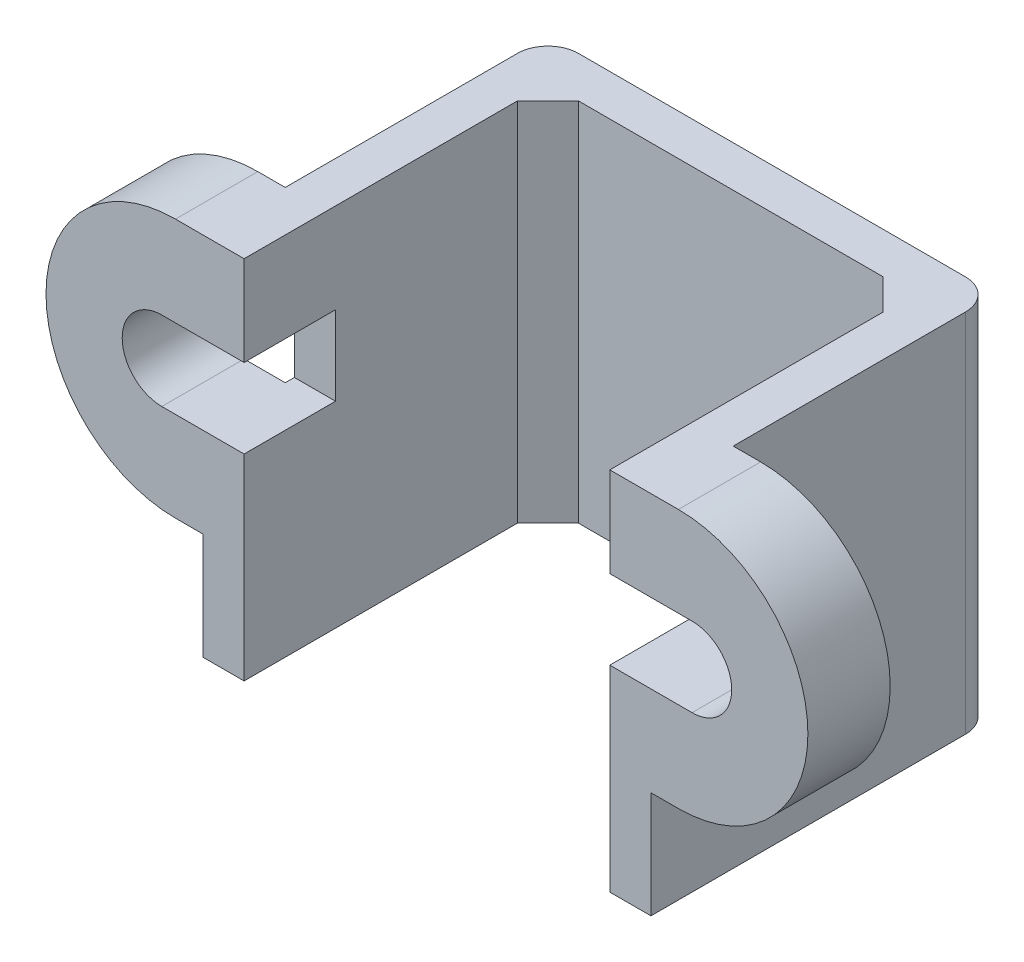
ISO-10303-21;
HEADER;
FILE_DESCRIPTION(('STEP AP214'),'2;1');
FILE_NAME('part.step','',(''),(''),'','','');
FILE_SCHEMA(('AUTOMOTIVE_DESIGN { 1 0 10303 214 1 1 1 1 }'));
ENDSEC;
DATA;
#1=APPLICATION_CONTEXT('core data for automotive mechanical design processes');
#2=APPLICATION_PROTOCOL_DEFINITION('international standard','automotive_design',2000,#1);
#3=PRODUCT_CONTEXT('',#1,'mechanical');
#4=PRODUCT('Part','Part','',(#3));
#5=PRODUCT_RELATED_PRODUCT_CATEGORY('part','',(#4));
#6=PRODUCT_DEFINITION_FORMATION('','',#4);
#7=PRODUCT_DEFINITION_CONTEXT('part definition',#1,'design');
#8=PRODUCT_DEFINITION('design','',#6,#7);
#9=PRODUCT_DEFINITION_SHAPE('','',#8);
#10=(LENGTH_UNIT() NAMED_UNIT(*) SI_UNIT(.MILLI.,.METRE.));
#11=(NAMED_UNIT(*) PLANE_ANGLE_UNIT() SI_UNIT($,.RADIAN.));
#12=(NAMED_UNIT(*) SI_UNIT($,.STERADIAN.) SOLID_ANGLE_UNIT());
#13=UNCERTAINTY_MEASURE_WITH_UNIT(LENGTH_MEASURE(1.E-05),#10,'distance_accuracy_value','');
#14=(GEOMETRIC_REPRESENTATION_CONTEXT(3) GLOBAL_UNCERTAINTY_ASSIGNED_CONTEXT((#13)) GLOBAL_UNIT_ASSIGNED_CONTEXT((#10,
#11,#12)) REPRESENTATION_CONTEXT('',''));
#15=CARTESIAN_POINT('',(0.,0.,0.));
#16=DIRECTION('',(0.,0.,1.));
#17=DIRECTION('',(1.,0.,0.));
#18=AXIS2_PLACEMENT_3D('',#15,#16,#17);
#19=CARTESIAN_POINT('',(7.35,6.,11.32));
#20=DIRECTION('',(0.,0.,1.));
#21=DIRECTION('',(1.,0.,0.));
#22=AXIS2_PLACEMENT_3D('',#19,#20,#21);
#23=PLANE('',#22);
#24=DIRECTION('',(0.,1.,0.));
#25=VECTOR('',#24,1.);
#26=CARTESIAN_POINT('',(6.,6.,11.32));
#27=LINE('',#26,#25);
#28=CARTESIAN_POINT('',(6.,3.05,11.32));
#29=VERTEX_POINT('',#28);
#30=CARTESIAN_POINT('',(6.,6.,11.32));
#31=VERTEX_POINT('',#30);
#32=EDGE_CURVE('E310',#29,#31,#27,.T.);
#33=ORIENTED_EDGE('',*,*,#32,.F.);
#34=DIRECTION('',(1.,0.,0.));
#35=VECTOR('',#34,1.);
#36=CARTESIAN_POINT('',(6.,3.05,11.32));
#37=LINE('',#36,#35);
#38=CARTESIAN_POINT('',(8.7,3.05,11.32));
#39=VERTEX_POINT('',#38);
#40=EDGE_CURVE('E255',#29,#39,#37,.T.);
#41=ORIENTED_EDGE('',*,*,#40,.T.);
#42=CARTESIAN_POINT('',(8.7,1.75,11.32));
#43=DIRECTION('',(0.,0.,-1.));
#44=DIRECTION('',(-1.,0.,0.));
#45=AXIS2_PLACEMENT_3D('',#42,#43,#44);
#46=CIRCLE('',#45,1.3);
#47=CARTESIAN_POINT('',(8.7,0.45,11.32));
#48=VERTEX_POINT('',#47);
#49=EDGE_CURVE('E787',#39,#48,#46,.T.);
#50=ORIENTED_EDGE('',*,*,#49,.T.);
#51=DIRECTION('',(-1.,0.,0.));
#52=VECTOR('',#51,1.);
#53=CARTESIAN_POINT('',(8.7,0.45,11.32));
#54=LINE('',#53,#52);
#55=CARTESIAN_POINT('',(6.,0.45,11.32));
#56=VERTEX_POINT('',#55);
#57=EDGE_CURVE('E793',#48,#56,#54,.T.);
#58=ORIENTED_EDGE('',*,*,#57,.T.);
#59=CARTESIAN_POINT('',(6.,-6.,11.32));
#60=VERTEX_POINT('',#59);
#61=EDGE_CURVE('E261',#60,#56,#27,.T.);
#62=ORIENTED_EDGE('',*,*,#61,.F.);
#63=DIRECTION('',(-1.,0.,0.));
#64=VECTOR('',#63,1.);
#65=CARTESIAN_POINT('',(7.35,-6.,11.32));
#66=LINE('',#65,#64);
#67=CARTESIAN_POINT('',(7.35,-6.,11.32));
#68=VERTEX_POINT('',#67);
#69=EDGE_CURVE('E308',#68,#60,#66,.T.);
#70=ORIENTED_EDGE('',*,*,#69,.F.);
#71=DIRECTION('',(0.,1.,0.));
#72=VECTOR('',#71,1.);
#73=CARTESIAN_POINT('',(7.35,6.,11.32));
#74=LINE('',#73,#72);
#75=CARTESIAN_POINT('',(7.35,-2.5,11.32));
#76=VERTEX_POINT('',#75);
#77=EDGE_CURVE('E302',#68,#76,#74,.T.);
#78=ORIENTED_EDGE('',*,*,#77,.T.);
#79=DIRECTION('',(-1.,0.,0.));
#80=VECTOR('',#79,1.);
#81=CARTESIAN_POINT('',(8.25,-2.5,11.32));
#82=LINE('',#81,#80);
#83=CARTESIAN_POINT('',(8.25,-2.5,11.32));
#84=VERTEX_POINT('',#83);
#85=EDGE_CURVE('E276',#84,#76,#82,.T.);
#86=ORIENTED_EDGE('',*,*,#85,.F.);
#87=CARTESIAN_POINT('',(8.25,1.75,11.32));
#88=DIRECTION('',(0.,0.,-1.));
#89=DIRECTION('',(-1.,0.,0.));
#90=AXIS2_PLACEMENT_3D('',#87,#88,#89);
#91=CIRCLE('',#90,4.25);
#92=CARTESIAN_POINT('',(8.25,6.,11.32));
#93=VERTEX_POINT('',#92);
#94=EDGE_CURVE('E289',#93,#84,#91,.T.);
#95=ORIENTED_EDGE('',*,*,#94,.F.);
#96=DIRECTION('',(-1.,0.,0.));
#97=VECTOR('',#96,1.);
#98=CARTESIAN_POINT('',(7.35,6.,11.32));
#99=LINE('',#98,#97);
#100=EDGE_CURVE('E315',#93,#31,#99,.T.);
#101=ORIENTED_EDGE('',*,*,#100,.T.);
#102=EDGE_LOOP('',(#33,#41,#50,#58,#62,#70,#78,#86,#95,#101));
#103=FACE_BOUND('',#102,.T.);
#104=ADVANCED_FACE('F35',(#103),#23,.T.);
#105=CARTESIAN_POINT('',(7.35,0.,0.));
#106=DIRECTION('',(1.,0.,0.));
#107=DIRECTION('',(0.,0.,1.));
#108=AXIS2_PLACEMENT_3D('',#105,#106,#107);
#109=PLANE('',#108);
#110=DIRECTION('',(0.,0.,1.));
#111=VECTOR('',#110,1.);
#112=CARTESIAN_POINT('',(7.35,-6.,0.));
#113=LINE('',#112,#111);
#114=CARTESIAN_POINT('',(7.35,-6.,1.));
#115=VERTEX_POINT('',#114);
#116=EDGE_CURVE('E306',#115,#68,#113,.T.);
#117=ORIENTED_EDGE('',*,*,#116,.F.);
#118=DIRECTION('',(0.,-1.,0.));
#119=VECTOR('',#118,1.);
#120=CARTESIAN_POINT('',(7.35,6.,1.));
#121=LINE('',#120,#119);
#122=CARTESIAN_POINT('',(7.35,6.,1.));
#123=VERTEX_POINT('',#122);
#124=EDGE_CURVE('E58',#115,#123,#121,.F.);
#125=ORIENTED_EDGE('',*,*,#124,.T.);
#126=DIRECTION('',(0.,0.,-1.));
#127=VECTOR('',#126,1.);
#128=CARTESIAN_POINT('',(7.35,6.,0.));
#129=LINE('',#128,#127);
#130=CARTESIAN_POINT('',(7.35,6.,8.62));
#131=VERTEX_POINT('',#130);
#132=EDGE_CURVE('E300',#131,#123,#129,.T.);
#133=ORIENTED_EDGE('',*,*,#132,.F.);
#134=DIRECTION('',(0.,1.,0.));
#135=VECTOR('',#134,1.);
#136=CARTESIAN_POINT('',(7.35,-2.5,8.62));
#137=LINE('',#136,#135);
#138=CARTESIAN_POINT('',(7.35,3.05,8.62));
#139=VERTEX_POINT('',#138);
#140=EDGE_CURVE('E281',#139,#131,#137,.T.);
#141=ORIENTED_EDGE('',*,*,#140,.F.);
#142=DIRECTION('',(0.,0.,-1.));
#143=VECTOR('',#142,1.);
#144=CARTESIAN_POINT('',(7.35,3.05,0.));
#145=LINE('',#144,#143);
#146=CARTESIAN_POINT('',(7.35,3.05,8.32));
#147=VERTEX_POINT('',#146);
#148=EDGE_CURVE('E270',#139,#147,#145,.T.);
#149=ORIENTED_EDGE('',*,*,#148,.T.);
#150=DIRECTION('',(0.,-1.,0.));
#151=VECTOR('',#150,1.);
#152=CARTESIAN_POINT('',(7.35,0.,8.32));
#153=LINE('',#152,#151);
#154=CARTESIAN_POINT('',(7.35,0.45,8.32));
#155=VERTEX_POINT('',#154);
#156=EDGE_CURVE('E274',#147,#155,#153,.T.);
#157=ORIENTED_EDGE('',*,*,#156,.T.);
#158=DIRECTION('',(0.,0.,1.));
#159=VECTOR('',#158,1.);
#160=CARTESIAN_POINT('',(7.35,0.45,0.));
#161=LINE('',#160,#159);
#162=CARTESIAN_POINT('',(7.35,0.45,8.62));
#163=VERTEX_POINT('',#162);
#164=EDGE_CURVE('E243',#155,#163,#161,.T.);
#165=ORIENTED_EDGE('',*,*,#164,.T.);
#166=CARTESIAN_POINT('',(7.35,-2.5,8.62));
#167=VERTEX_POINT('',#166);
#168=EDGE_CURVE('E277',#167,#163,#137,.T.);
#169=ORIENTED_EDGE('',*,*,#168,.F.);
#170=DIRECTION('',(0.,0.,1.));
#171=VECTOR('',#170,1.);
#172=CARTESIAN_POINT('',(7.35,-2.5,8.62));
#173=LINE('',#172,#171);
#174=EDGE_CURVE('E287',#167,#76,#173,.T.);
#175=ORIENTED_EDGE('',*,*,#174,.T.);
#176=ORIENTED_EDGE('',*,*,#77,.F.);
#177=EDGE_LOOP('',(#117,#125,#133,#141,#149,#157,#165,#169,#175,#176));
#178=FACE_BOUND('',#177,.T.);
#179=ADVANCED_FACE('F469',(#178),#109,.T.);
#180=CARTESIAN_POINT('',(6.,0.,0.));
#181=DIRECTION('',(1.,0.,0.));
#182=DIRECTION('',(0.,0.,1.));
#183=AXIS2_PLACEMENT_3D('',#180,#181,#182);
#184=PLANE('',#183);
#185=DIRECTION('',(0.,0.,-1.));
#186=VECTOR('',#185,1.);
#187=CARTESIAN_POINT('',(6.,6.,0.));
#188=LINE('',#187,#186);
#189=CARTESIAN_POINT('',(6.,6.,2.35));
#190=VERTEX_POINT('',#189);
#191=EDGE_CURVE('E294',#31,#190,#188,.T.);
#192=ORIENTED_EDGE('',*,*,#191,.T.);
#193=DIRECTION('',(0.,-1.,0.));
#194=VECTOR('',#193,1.);
#195=CARTESIAN_POINT('',(6.,0.,2.35));
#196=LINE('',#195,#194);
#197=CARTESIAN_POINT('',(6.,-6.,2.35));
#198=VERTEX_POINT('',#197);
#199=EDGE_CURVE('E434',#190,#198,#196,.T.);
#200=ORIENTED_EDGE('',*,*,#199,.T.);
#201=DIRECTION('',(0.,0.,1.));
#202=VECTOR('',#201,1.);
#203=CARTESIAN_POINT('',(6.,-6.,0.));
#204=LINE('',#203,#202);
#205=EDGE_CURVE('E303',#198,#60,#204,.T.);
#206=ORIENTED_EDGE('',*,*,#205,.T.);
#207=ORIENTED_EDGE('',*,*,#61,.T.);
#208=DIRECTION('',(0.,0.,1.));
#209=VECTOR('',#208,1.);
#210=CARTESIAN_POINT('',(6.,0.45,8.32));
#211=LINE('',#210,#209);
#212=CARTESIAN_POINT('',(6.,0.45,8.32));
#213=VERTEX_POINT('',#212);
#214=EDGE_CURVE('E240',#213,#56,#211,.T.);
#215=ORIENTED_EDGE('',*,*,#214,.F.);
#216=DIRECTION('',(0.,1.,0.));
#217=VECTOR('',#216,1.);
#218=CARTESIAN_POINT('',(6.,0.45,8.32));
#219=LINE('',#218,#217);
#220=CARTESIAN_POINT('',(6.,3.05,8.32));
#221=VERTEX_POINT('',#220);
#222=EDGE_CURVE('E247',#213,#221,#219,.T.);
#223=ORIENTED_EDGE('',*,*,#222,.T.);
#224=DIRECTION('',(0.,0.,1.));
#225=VECTOR('',#224,1.);
#226=CARTESIAN_POINT('',(6.,3.05,8.32));
#227=LINE('',#226,#225);
#228=EDGE_CURVE('E271',#221,#29,#227,.T.);
#229=ORIENTED_EDGE('',*,*,#228,.T.);
#230=ORIENTED_EDGE('',*,*,#32,.T.);
#231=EDGE_LOOP('',(#192,#200,#206,#207,#215,#223,#229,#230));
#232=FACE_BOUND('',#231,.T.);
#233=ADVANCED_FACE('F259',(#232),#184,.F.);
#234=CARTESIAN_POINT('',(8.25,1.75,8.62));
#235=DIRECTION('',(0.,0.,1.));
#236=DIRECTION('',(-1.,0.,0.));
#237=AXIS2_PLACEMENT_3D('',#234,#235,#236);
#238=PLANE('',#237);
#239=DIRECTION('',(1.,0.,0.));
#240=VECTOR('',#239,1.);
#241=CARTESIAN_POINT('',(8.25,3.05,8.62));
#242=LINE('',#241,#240);
#243=CARTESIAN_POINT('',(8.7,3.05,8.62));
#244=VERTEX_POINT('',#243);
#245=EDGE_CURVE('E424',#139,#244,#242,.T.);
#246=ORIENTED_EDGE('',*,*,#245,.F.);
#247=ORIENTED_EDGE('',*,*,#140,.T.);
#248=DIRECTION('',(1.,0.,0.));
#249=VECTOR('',#248,1.);
#250=CARTESIAN_POINT('',(7.35,6.,8.62));
#251=LINE('',#250,#249);
#252=CARTESIAN_POINT('',(8.25,6.,8.62));
#253=VERTEX_POINT('',#252);
#254=EDGE_CURVE('E285',#131,#253,#251,.T.);
#255=ORIENTED_EDGE('',*,*,#254,.T.);
#256=CARTESIAN_POINT('',(8.25,1.75,8.62));
#257=DIRECTION('',(0.,0.,-1.));
#258=DIRECTION('',(-1.,0.,0.));
#259=AXIS2_PLACEMENT_3D('',#256,#257,#258);
#260=CIRCLE('',#259,4.25);
#261=CARTESIAN_POINT('',(8.25,-2.5,8.62));
#262=VERTEX_POINT('',#261);
#263=EDGE_CURVE('E283',#253,#262,#260,.T.);
#264=ORIENTED_EDGE('',*,*,#263,.T.);
#265=DIRECTION('',(-1.,0.,0.));
#266=VECTOR('',#265,1.);
#267=CARTESIAN_POINT('',(8.25,-2.5,8.62));
#268=LINE('',#267,#266);
#269=EDGE_CURVE('E280',#262,#167,#268,.T.);
#270=ORIENTED_EDGE('',*,*,#269,.T.);
#271=ORIENTED_EDGE('',*,*,#168,.T.);
#272=DIRECTION('',(-1.,0.,0.));
#273=VECTOR('',#272,1.);
#274=CARTESIAN_POINT('',(8.25,0.45,8.62));
#275=LINE('',#274,#273);
#276=CARTESIAN_POINT('',(8.7,0.45,8.62));
#277=VERTEX_POINT('',#276);
#278=EDGE_CURVE('E419',#277,#163,#275,.T.);
#279=ORIENTED_EDGE('',*,*,#278,.F.);
#280=CARTESIAN_POINT('',(8.7,1.75,8.62));
#281=DIRECTION('',(0.,0.,1.));
#282=DIRECTION('',(1.,0.,0.));
#283=AXIS2_PLACEMENT_3D('',#280,#281,#282);
#284=CIRCLE('',#283,1.3);
#285=EDGE_CURVE('E421',#244,#277,#284,.F.);
#286=ORIENTED_EDGE('',*,*,#285,.F.);
#287=EDGE_LOOP('',(#246,#247,#255,#264,#270,#271,#279,#286));
#288=FACE_BOUND('',#287,.T.);
#289=ADVANCED_FACE('F565',(#288),#238,.F.);
#290=CARTESIAN_POINT('',(-6.,6.,1.35));
#291=DIRECTION('',(0.,-1.,0.));
#292=DIRECTION('',(0.,0.,-1.));
#293=AXIS2_PLACEMENT_3D('',#290,#291,#292);
#294=PLANE('',#293);
#295=ORIENTED_EDGE('',*,*,#132,.T.);
#296=CARTESIAN_POINT('',(6.35,6.,1.));
#297=DIRECTION('',(0.,-1.,0.));
#298=DIRECTION('',(0.,0.,-1.));
#299=AXIS2_PLACEMENT_3D('',#296,#297,#298);
#300=CIRCLE('',#299,1.);
#301=CARTESIAN_POINT('',(6.35,6.,0.));
#302=VERTEX_POINT('',#301);
#303=EDGE_CURVE('E43',#123,#302,#300,.F.);
#304=ORIENTED_EDGE('',*,*,#303,.T.);
#305=DIRECTION('',(-1.,0.,0.));
#306=VECTOR('',#305,1.);
#307=CARTESIAN_POINT('',(-6.,6.,0.));
#308=LINE('',#307,#306);
#309=CARTESIAN_POINT('',(-6.35,6.,0.));
#310=VERTEX_POINT('',#309);
#311=EDGE_CURVE('E399',#302,#310,#308,.T.);
#312=ORIENTED_EDGE('',*,*,#311,.T.);
#313=CARTESIAN_POINT('',(-6.35,6.,1.));
#314=DIRECTION('',(0.,-1.,0.));
#315=DIRECTION('',(0.,0.,-1.));
#316=AXIS2_PLACEMENT_3D('',#313,#314,#315);
#317=CIRCLE('',#316,1.);
#318=CARTESIAN_POINT('',(-7.35,6.,1.));
#319=VERTEX_POINT('',#318);
#320=EDGE_CURVE('E50',#310,#319,#317,.F.);
#321=ORIENTED_EDGE('',*,*,#320,.T.);
#322=DIRECTION('',(0.,0.,-1.));
#323=VECTOR('',#322,1.);
#324=CARTESIAN_POINT('',(-7.35,6.,0.));
#325=LINE('',#324,#323);
#326=CARTESIAN_POINT('',(-7.35,6.,8.62));
#327=VERTEX_POINT('',#326);
#328=EDGE_CURVE('E384',#327,#319,#325,.T.);
#329=ORIENTED_EDGE('',*,*,#328,.F.);
#330=DIRECTION('',(-1.,0.,0.));
#331=VECTOR('',#330,1.);
#332=CARTESIAN_POINT('',(-7.35,6.,8.62));
#333=LINE('',#332,#331);
#334=CARTESIAN_POINT('',(-8.25,6.,8.62));
#335=VERTEX_POINT('',#334);
#336=EDGE_CURVE('E355',#327,#335,#333,.T.);
#337=ORIENTED_EDGE('',*,*,#336,.T.);
#338=DIRECTION('',(0.,0.,1.));
#339=VECTOR('',#338,1.);
#340=CARTESIAN_POINT('',(-8.25,6.,8.62));
#341=LINE('',#340,#339);
#342=CARTESIAN_POINT('',(-8.25,6.,11.32));
#343=VERTEX_POINT('',#342);
#344=EDGE_CURVE('E365',#335,#343,#341,.T.);
#345=ORIENTED_EDGE('',*,*,#344,.T.);
#346=DIRECTION('',(1.,0.,0.));
#347=VECTOR('',#346,1.);
#348=CARTESIAN_POINT('',(-7.35,6.,11.32));
#349=LINE('',#348,#347);
#350=CARTESIAN_POINT('',(-6.,6.,11.32));
#351=VERTEX_POINT('',#350);
#352=EDGE_CURVE('E386',#343,#351,#349,.T.);
#353=ORIENTED_EDGE('',*,*,#352,.T.);
#354=DIRECTION('',(0.,0.,-1.));
#355=VECTOR('',#354,1.);
#356=CARTESIAN_POINT('',(-6.,6.,0.));
#357=LINE('',#356,#355);
#358=CARTESIAN_POINT('',(-6.,6.,2.35));
#359=VERTEX_POINT('',#358);
#360=EDGE_CURVE('E381',#351,#359,#357,.T.);
#361=ORIENTED_EDGE('',*,*,#360,.T.);
#362=DIRECTION('',(0.707106781186551,0.,-0.707106781186544));
#363=VECTOR('',#362,1.);
#364=CARTESIAN_POINT('',(-5.5,6.,1.85));
#365=LINE('',#364,#363);
#366=CARTESIAN_POINT('',(-4.99999999999999,6.,1.35));
#367=VERTEX_POINT('',#366);
#368=EDGE_CURVE('E438',#359,#367,#365,.T.);
#369=ORIENTED_EDGE('',*,*,#368,.T.);
#370=DIRECTION('',(-1.,0.,0.));
#371=VECTOR('',#370,1.);
#372=CARTESIAN_POINT('',(-6.,6.,1.35));
#373=LINE('',#372,#371);
#374=CARTESIAN_POINT('',(4.99999999999999,6.,1.35));
#375=VERTEX_POINT('',#374);
#376=EDGE_CURVE('E400',#375,#367,#373,.T.);
#377=ORIENTED_EDGE('',*,*,#376,.F.);
#378=DIRECTION('',(0.707106781186551,0.,0.707106781186544));
#379=VECTOR('',#378,1.);
#380=CARTESIAN_POINT('',(-0.500000000000061,6.,-4.15));
#381=LINE('',#380,#379);
#382=EDGE_CURVE('E440',#375,#190,#381,.T.);
#383=ORIENTED_EDGE('',*,*,#382,.T.);
#384=ORIENTED_EDGE('',*,*,#191,.F.);
#385=ORIENTED_EDGE('',*,*,#100,.F.);
#386=DIRECTION('',(0.,0.,1.));
#387=VECTOR('',#386,1.);
#388=CARTESIAN_POINT('',(8.25,6.,8.62));
#389=LINE('',#388,#387);
#390=EDGE_CURVE('E291',#253,#93,#389,.T.);
#391=ORIENTED_EDGE('',*,*,#390,.F.);
#392=ORIENTED_EDGE('',*,*,#254,.F.);
#393=EDGE_LOOP('',(#295,#304,#312,#321,#329,#337,#345,#353,#361,#369,#377,#383,#384,#385,#391,#392));
#394=FACE_BOUND('',#393,.T.);
#395=ADVANCED_FACE('F456',(#394),#294,.F.);
#396=CARTESIAN_POINT('',(-6.,-6.,1.35));
#397=DIRECTION('',(0.,1.,0.));
#398=DIRECTION('',(0.,0.,1.));
#399=AXIS2_PLACEMENT_3D('',#396,#397,#398);
#400=PLANE('',#399);
#401=DIRECTION('',(1.,0.,0.));
#402=VECTOR('',#401,1.);
#403=CARTESIAN_POINT('',(-6.,-6.,0.));
#404=LINE('',#403,#402);
#405=CARTESIAN_POINT('',(-6.35,-6.,0.));
#406=VERTEX_POINT('',#405);
#407=CARTESIAN_POINT('',(6.35,-6.,0.));
#408=VERTEX_POINT('',#407);
#409=EDGE_CURVE('E404',#406,#408,#404,.T.);
#410=ORIENTED_EDGE('',*,*,#409,.T.);
#411=CARTESIAN_POINT('',(6.35,-6.,1.));
#412=DIRECTION('',(0.,1.,0.));
#413=DIRECTION('',(0.,0.,1.));
#414=AXIS2_PLACEMENT_3D('',#411,#412,#413);
#415=CIRCLE('',#414,1.);
#416=EDGE_CURVE('E451',#408,#115,#415,.F.);
#417=ORIENTED_EDGE('',*,*,#416,.T.);
#418=ORIENTED_EDGE('',*,*,#116,.T.);
#419=ORIENTED_EDGE('',*,*,#69,.T.);
#420=ORIENTED_EDGE('',*,*,#205,.F.);
#421=DIRECTION('',(-0.707106781186551,0.,-0.707106781186544));
#422=VECTOR('',#421,1.);
#423=CARTESIAN_POINT('',(-0.500000000000061,-6.,-4.15));
#424=LINE('',#423,#422);
#425=CARTESIAN_POINT('',(4.99999999999999,-6.,1.35));
#426=VERTEX_POINT('',#425);
#427=EDGE_CURVE('E442',#198,#426,#424,.T.);
#428=ORIENTED_EDGE('',*,*,#427,.T.);
#429=DIRECTION('',(1.,0.,0.));
#430=VECTOR('',#429,1.);
#431=CARTESIAN_POINT('',(-6.,-6.,1.35));
#432=LINE('',#431,#430);
#433=CARTESIAN_POINT('',(-4.99999999999999,-6.,1.35));
#434=VERTEX_POINT('',#433);
#435=EDGE_CURVE('E403',#434,#426,#432,.T.);
#436=ORIENTED_EDGE('',*,*,#435,.F.);
#437=DIRECTION('',(-0.707106781186551,0.,0.707106781186544));
#438=VECTOR('',#437,1.);
#439=CARTESIAN_POINT('',(-5.5,-6.,1.85));
#440=LINE('',#439,#438);
#441=CARTESIAN_POINT('',(-6.,-6.,2.35));
#442=VERTEX_POINT('',#441);
#443=EDGE_CURVE('E436',#434,#442,#440,.T.);
#444=ORIENTED_EDGE('',*,*,#443,.T.);
#445=DIRECTION('',(0.,0.,1.));
#446=VECTOR('',#445,1.);
#447=CARTESIAN_POINT('',(-6.,-6.,0.));
#448=LINE('',#447,#446);
#449=CARTESIAN_POINT('',(-6.,-6.,11.32));
#450=VERTEX_POINT('',#449);
#451=EDGE_CURVE('E373',#442,#450,#448,.T.);
#452=ORIENTED_EDGE('',*,*,#451,.T.);
#453=DIRECTION('',(1.,0.,0.));
#454=VECTOR('',#453,1.);
#455=CARTESIAN_POINT('',(-7.35,-6.,11.32));
#456=LINE('',#455,#454);
#457=CARTESIAN_POINT('',(-7.35,-6.,11.32));
#458=VERTEX_POINT('',#457);
#459=EDGE_CURVE('E396',#458,#450,#456,.T.);
#460=ORIENTED_EDGE('',*,*,#459,.F.);
#461=DIRECTION('',(0.,0.,1.));
#462=VECTOR('',#461,1.);
#463=CARTESIAN_POINT('',(-7.35,-6.,0.));
#464=LINE('',#463,#462);
#465=CARTESIAN_POINT('',(-7.35,-6.,1.));
#466=VERTEX_POINT('',#465);
#467=EDGE_CURVE('E378',#466,#458,#464,.T.);
#468=ORIENTED_EDGE('',*,*,#467,.F.);
#469=CARTESIAN_POINT('',(-6.35,-6.,1.));
#470=DIRECTION('',(0.,1.,0.));
#471=DIRECTION('',(0.,0.,1.));
#472=AXIS2_PLACEMENT_3D('',#469,#470,#471);
#473=CIRCLE('',#472,1.);
#474=EDGE_CURVE('E449',#466,#406,#473,.F.);
#475=ORIENTED_EDGE('',*,*,#474,.T.);
#476=EDGE_LOOP('',(#410,#417,#418,#419,#420,#428,#436,#444,#452,#460,#468,#475));
#477=FACE_BOUND('',#476,.T.);
#478=ADVANCED_FACE('F466',(#477),#400,.F.);
#479=CARTESIAN_POINT('',(0.,0.,1.35));
#480=DIRECTION('',(0.,0.,1.));
#481=DIRECTION('',(1.,0.,0.));
#482=AXIS2_PLACEMENT_3D('',#479,#480,#481);
#483=PLANE('',#482);
#484=ORIENTED_EDGE('',*,*,#376,.T.);
#485=DIRECTION('',(0.,-1.,0.));
#486=VECTOR('',#485,1.);
#487=CARTESIAN_POINT('',(-4.99999999999999,0.,1.35));
#488=LINE('',#487,#486);
#489=EDGE_CURVE('E429',#367,#434,#488,.T.);
#490=ORIENTED_EDGE('',*,*,#489,.T.);
#491=ORIENTED_EDGE('',*,*,#435,.T.);
#492=DIRECTION('',(0.,1.,0.));
#493=VECTOR('',#492,1.);
#494=CARTESIAN_POINT('',(4.99999999999999,0.,1.35));
#495=LINE('',#494,#493);
#496=EDGE_CURVE('E426',#426,#375,#495,.T.);
#497=ORIENTED_EDGE('',*,*,#496,.T.);
#498=EDGE_LOOP('',(#484,#490,#491,#497));
#499=FACE_BOUND('',#498,.T.);
#500=ADVANCED_FACE('F485',(#499),#483,.T.);
#501=CARTESIAN_POINT('',(0.,0.,0.));
#502=DIRECTION('',(0.,0.,1.));
#503=DIRECTION('',(1.,0.,0.));
#504=AXIS2_PLACEMENT_3D('',#501,#502,#503);
#505=PLANE('',#504);
#506=ORIENTED_EDGE('',*,*,#311,.F.);
#507=DIRECTION('',(0.,-1.,0.));
#508=VECTOR('',#507,1.);
#509=CARTESIAN_POINT('',(6.35,-6.,0.));
#510=LINE('',#509,#508);
#511=EDGE_CURVE('E446',#302,#408,#510,.T.);
#512=ORIENTED_EDGE('',*,*,#511,.T.);
#513=ORIENTED_EDGE('',*,*,#409,.F.);
#514=DIRECTION('',(0.,-1.,0.));
#515=VECTOR('',#514,1.);
#516=CARTESIAN_POINT('',(-6.35,6.,0.));
#517=LINE('',#516,#515);
#518=EDGE_CURVE('E444',#406,#310,#517,.F.);
#519=ORIENTED_EDGE('',*,*,#518,.T.);
#520=EDGE_LOOP('',(#506,#512,#513,#519));
#521=FACE_BOUND('',#520,.T.);
#522=ADVANCED_FACE('F461',(#521),#505,.F.);
#523=CARTESIAN_POINT('',(-7.35,6.,11.32));
#524=DIRECTION('',(0.,0.,-1.));
#525=DIRECTION('',(-1.,0.,0.));
#526=AXIS2_PLACEMENT_3D('',#523,#524,#525);
#527=PLANE('',#526);
#528=DIRECTION('',(0.,1.,0.));
#529=VECTOR('',#528,1.);
#530=CARTESIAN_POINT('',(-6.,6.,11.32));
#531=LINE('',#530,#529);
#532=CARTESIAN_POINT('',(-6.,0.45,11.32));
#533=VERTEX_POINT('',#532);
#534=EDGE_CURVE('E389',#450,#533,#531,.T.);
#535=ORIENTED_EDGE('',*,*,#534,.T.);
#536=DIRECTION('',(1.,0.,0.));
#537=VECTOR('',#536,1.);
#538=CARTESIAN_POINT('',(-8.7,0.45,11.32));
#539=LINE('',#538,#537);
#540=CARTESIAN_POINT('',(-8.7,0.45,11.32));
#541=VERTEX_POINT('',#540);
#542=EDGE_CURVE('E323',#541,#533,#539,.T.);
#543=ORIENTED_EDGE('',*,*,#542,.F.);
#544=CARTESIAN_POINT('',(-8.7,1.75,11.32));
#545=DIRECTION('',(0.,0.,1.));
#546=DIRECTION('',(1.,0.,0.));
#547=AXIS2_PLACEMENT_3D('',#544,#545,#546);
#548=CIRCLE('',#547,1.3);
#549=CARTESIAN_POINT('',(-8.7,3.05,11.32));
#550=VERTEX_POINT('',#549);
#551=EDGE_CURVE('E332',#550,#541,#548,.T.);
#552=ORIENTED_EDGE('',*,*,#551,.F.);
#553=DIRECTION('',(-1.,0.,0.));
#554=VECTOR('',#553,1.);
#555=CARTESIAN_POINT('',(-6.,3.05,11.32));
#556=LINE('',#555,#554);
#557=CARTESIAN_POINT('',(-6.,3.05,11.32));
#558=VERTEX_POINT('',#557);
#559=EDGE_CURVE('E318',#558,#550,#556,.T.);
#560=ORIENTED_EDGE('',*,*,#559,.F.);
#561=EDGE_CURVE('E388',#558,#351,#531,.T.);
#562=ORIENTED_EDGE('',*,*,#561,.T.);
#563=ORIENTED_EDGE('',*,*,#352,.F.);
#564=CARTESIAN_POINT('',(-8.25,1.75,11.32));
#565=DIRECTION('',(0.,0.,1.));
#566=DIRECTION('',(1.,0.,0.));
#567=AXIS2_PLACEMENT_3D('',#564,#565,#566);
#568=CIRCLE('',#567,4.25);
#569=CARTESIAN_POINT('',(-8.25,-2.5,11.32));
#570=VERTEX_POINT('',#569);
#571=EDGE_CURVE('E351',#343,#570,#568,.T.);
#572=ORIENTED_EDGE('',*,*,#571,.T.);
#573=DIRECTION('',(1.,0.,0.));
#574=VECTOR('',#573,1.);
#575=CARTESIAN_POINT('',(-8.25,-2.5,11.32));
#576=LINE('',#575,#574);
#577=CARTESIAN_POINT('',(-7.35,-2.5,11.32));
#578=VERTEX_POINT('',#577);
#579=EDGE_CURVE('E368',#570,#578,#576,.T.);
#580=ORIENTED_EDGE('',*,*,#579,.T.);
#581=DIRECTION('',(0.,1.,0.));
#582=VECTOR('',#581,1.);
#583=CARTESIAN_POINT('',(-7.35,6.,11.32));
#584=LINE('',#583,#582);
#585=EDGE_CURVE('E380',#458,#578,#584,.T.);
#586=ORIENTED_EDGE('',*,*,#585,.F.);
#587=ORIENTED_EDGE('',*,*,#459,.T.);
#588=EDGE_LOOP('',(#535,#543,#552,#560,#562,#563,#572,#580,#586,#587));
#589=FACE_BOUND('',#588,.T.);
#590=ADVANCED_FACE('F501',(#589),#527,.F.);
#591=CARTESIAN_POINT('',(-7.35,0.,0.));
#592=DIRECTION('',(-1.,0.,0.));
#593=DIRECTION('',(0.,0.,1.));
#594=AXIS2_PLACEMENT_3D('',#591,#592,#593);
#595=PLANE('',#594);
#596=ORIENTED_EDGE('',*,*,#328,.T.);
#597=DIRECTION('',(0.,-1.,0.));
#598=VECTOR('',#597,1.);
#599=CARTESIAN_POINT('',(-7.35,-6.,1.));
#600=LINE('',#599,#598);
#601=EDGE_CURVE('E11',#319,#466,#600,.T.);
#602=ORIENTED_EDGE('',*,*,#601,.T.);
#603=ORIENTED_EDGE('',*,*,#467,.T.);
#604=ORIENTED_EDGE('',*,*,#585,.T.);
#605=DIRECTION('',(0.,0.,1.));
#606=VECTOR('',#605,1.);
#607=CARTESIAN_POINT('',(-7.35,-2.5,8.62));
#608=LINE('',#607,#606);
#609=CARTESIAN_POINT('',(-7.35,-2.5,8.62));
#610=VERTEX_POINT('',#609);
#611=EDGE_CURVE('E371',#610,#578,#608,.T.);
#612=ORIENTED_EDGE('',*,*,#611,.F.);
#613=DIRECTION('',(0.,1.,0.));
#614=VECTOR('',#613,1.);
#615=CARTESIAN_POINT('',(-7.35,-2.5,8.62));
#616=LINE('',#615,#614);
#617=CARTESIAN_POINT('',(-7.35,0.45,8.62));
#618=VERTEX_POINT('',#617);
#619=EDGE_CURVE('E352',#610,#618,#616,.T.);
#620=ORIENTED_EDGE('',*,*,#619,.T.);
#621=DIRECTION('',(0.,0.,1.));
#622=VECTOR('',#621,1.);
#623=CARTESIAN_POINT('',(-7.35,0.45,0.));
#624=LINE('',#623,#622);
#625=CARTESIAN_POINT('',(-7.35,0.45,8.32));
#626=VERTEX_POINT('',#625);
#627=EDGE_CURVE('E346',#626,#618,#624,.T.);
#628=ORIENTED_EDGE('',*,*,#627,.F.);
#629=DIRECTION('',(0.,1.,0.));
#630=VECTOR('',#629,1.);
#631=CARTESIAN_POINT('',(-7.35,0.,8.32));
#632=LINE('',#631,#630);
#633=CARTESIAN_POINT('',(-7.35,3.05,8.32));
#634=VERTEX_POINT('',#633);
#635=EDGE_CURVE('E348',#626,#634,#632,.T.);
#636=ORIENTED_EDGE('',*,*,#635,.T.);
#637=DIRECTION('',(0.,0.,-1.));
#638=VECTOR('',#637,1.);
#639=CARTESIAN_POINT('',(-7.35,3.05,0.));
#640=LINE('',#639,#638);
#641=CARTESIAN_POINT('',(-7.35,3.05,8.62));
#642=VERTEX_POINT('',#641);
#643=EDGE_CURVE('E339',#642,#634,#640,.T.);
#644=ORIENTED_EDGE('',*,*,#643,.F.);
#645=EDGE_CURVE('E356',#642,#327,#616,.T.);
#646=ORIENTED_EDGE('',*,*,#645,.T.);
#647=EDGE_LOOP('',(#596,#602,#603,#604,#612,#620,#628,#636,#644,#646));
#648=FACE_BOUND('',#647,.T.);
#649=ADVANCED_FACE('F506',(#648),#595,.T.);
#650=CARTESIAN_POINT('',(-6.,0.,0.));
#651=DIRECTION('',(-1.,0.,0.));
#652=DIRECTION('',(0.,0.,1.));
#653=AXIS2_PLACEMENT_3D('',#650,#651,#652);
#654=PLANE('',#653);
#655=ORIENTED_EDGE('',*,*,#451,.F.);
#656=DIRECTION('',(0.,1.,0.));
#657=VECTOR('',#656,1.);
#658=CARTESIAN_POINT('',(-6.,0.,2.35));
#659=LINE('',#658,#657);
#660=EDGE_CURVE('E432',#442,#359,#659,.T.);
#661=ORIENTED_EDGE('',*,*,#660,.T.);
#662=ORIENTED_EDGE('',*,*,#360,.F.);
#663=ORIENTED_EDGE('',*,*,#561,.F.);
#664=DIRECTION('',(0.,0.,1.));
#665=VECTOR('',#664,1.);
#666=CARTESIAN_POINT('',(-6.,3.05,8.32));
#667=LINE('',#666,#665);
#668=CARTESIAN_POINT('',(-6.,3.05,8.32));
#669=VERTEX_POINT('',#668);
#670=EDGE_CURVE('E329',#669,#558,#667,.T.);
#671=ORIENTED_EDGE('',*,*,#670,.F.);
#672=DIRECTION('',(0.,1.,0.));
#673=VECTOR('',#672,1.);
#674=CARTESIAN_POINT('',(-6.,0.45,8.32));
#675=LINE('',#674,#673);
#676=CARTESIAN_POINT('',(-6.,0.45,8.32));
#677=VERTEX_POINT('',#676);
#678=EDGE_CURVE('E319',#677,#669,#675,.T.);
#679=ORIENTED_EDGE('',*,*,#678,.F.);
#680=DIRECTION('',(0.,0.,1.));
#681=VECTOR('',#680,1.);
#682=CARTESIAN_POINT('',(-6.,0.45,8.32));
#683=LINE('',#682,#681);
#684=EDGE_CURVE('E336',#677,#533,#683,.T.);
#685=ORIENTED_EDGE('',*,*,#684,.T.);
#686=ORIENTED_EDGE('',*,*,#534,.F.);
#687=EDGE_LOOP('',(#655,#661,#662,#663,#671,#679,#685,#686));
#688=FACE_BOUND('',#687,.T.);
#689=ADVANCED_FACE('F497',(#688),#654,.F.);
#690=CARTESIAN_POINT('',(-8.25,-2.5,8.62));
#691=DIRECTION('',(0.,-1.,0.));
#692=DIRECTION('',(0.,0.,-1.));
#693=AXIS2_PLACEMENT_3D('',#690,#691,#692);
#694=PLANE('',#693);
#695=ORIENTED_EDGE('',*,*,#579,.F.);
#696=DIRECTION('',(0.,0.,1.));
#697=VECTOR('',#696,1.);
#698=CARTESIAN_POINT('',(-8.25,-2.5,8.62));
#699=LINE('',#698,#697);
#700=CARTESIAN_POINT('',(-8.25,-2.5,8.62));
#701=VERTEX_POINT('',#700);
#702=EDGE_CURVE('E374',#701,#570,#699,.T.);
#703=ORIENTED_EDGE('',*,*,#702,.F.);
#704=DIRECTION('',(1.,0.,0.));
#705=VECTOR('',#704,1.);
#706=CARTESIAN_POINT('',(-8.25,-2.5,8.62));
#707=LINE('',#706,#705);
#708=EDGE_CURVE('E362',#701,#610,#707,.T.);
#709=ORIENTED_EDGE('',*,*,#708,.T.);
#710=ORIENTED_EDGE('',*,*,#611,.T.);
#711=EDGE_LOOP('',(#695,#703,#709,#710));
#712=FACE_BOUND('',#711,.T.);
#713=ADVANCED_FACE('F544',(#712),#694,.T.);
#714=CARTESIAN_POINT('',(-8.25,1.75,8.62));
#715=DIRECTION('',(0.,0.,1.));
#716=DIRECTION('',(1.,0.,0.));
#717=AXIS2_PLACEMENT_3D('',#714,#715,#716);
#718=CYLINDRICAL_SURFACE('',#717,4.25);
#719=ORIENTED_EDGE('',*,*,#571,.F.);
#720=ORIENTED_EDGE('',*,*,#344,.F.);
#721=CARTESIAN_POINT('',(-8.25,1.75,8.62));
#722=DIRECTION('',(0.,0.,1.));
#723=DIRECTION('',(1.,0.,0.));
#724=AXIS2_PLACEMENT_3D('',#721,#722,#723);
#725=CIRCLE('',#724,4.25);
#726=EDGE_CURVE('E359',#335,#701,#725,.T.);
#727=ORIENTED_EDGE('',*,*,#726,.T.);
#728=ORIENTED_EDGE('',*,*,#702,.T.);
#729=EDGE_LOOP('',(#719,#720,#727,#728));
#730=FACE_BOUND('',#729,.T.);
#731=ADVANCED_FACE('F542',(#730),#718,.T.);
#732=CARTESIAN_POINT('',(-8.25,1.75,8.62));
#733=DIRECTION('',(0.,0.,1.));
#734=DIRECTION('',(1.,0.,0.));
#735=AXIS2_PLACEMENT_3D('',#732,#733,#734);
#736=PLANE('',#735);
#737=CARTESIAN_POINT('',(-8.7,1.75,8.62));
#738=DIRECTION('',(0.,0.,1.));
#739=DIRECTION('',(1.,0.,0.));
#740=AXIS2_PLACEMENT_3D('',#737,#738,#739);
#741=CIRCLE('',#740,1.3);
#742=CARTESIAN_POINT('',(-8.7,3.05,8.62));
#743=VERTEX_POINT('',#742);
#744=CARTESIAN_POINT('',(-8.7,0.45,8.62));
#745=VERTEX_POINT('',#744);
#746=EDGE_CURVE('E413',#743,#745,#741,.T.);
#747=ORIENTED_EDGE('',*,*,#746,.T.);
#748=DIRECTION('',(1.,0.,0.));
#749=VECTOR('',#748,1.);
#750=CARTESIAN_POINT('',(-8.25,0.45,8.62));
#751=LINE('',#750,#749);
#752=EDGE_CURVE('E416',#745,#618,#751,.T.);
#753=ORIENTED_EDGE('',*,*,#752,.T.);
#754=ORIENTED_EDGE('',*,*,#619,.F.);
#755=ORIENTED_EDGE('',*,*,#708,.F.);
#756=ORIENTED_EDGE('',*,*,#726,.F.);
#757=ORIENTED_EDGE('',*,*,#336,.F.);
#758=ORIENTED_EDGE('',*,*,#645,.F.);
#759=DIRECTION('',(-1.,0.,0.));
#760=VECTOR('',#759,1.);
#761=CARTESIAN_POINT('',(-8.25,3.05,8.62));
#762=LINE('',#761,#760);
#763=EDGE_CURVE('E407',#642,#743,#762,.T.);
#764=ORIENTED_EDGE('',*,*,#763,.T.);
#765=EDGE_LOOP('',(#747,#753,#754,#755,#756,#757,#758,#764));
#766=FACE_BOUND('',#765,.T.);
#767=ADVANCED_FACE('F535',(#766),#736,.F.);
#768=CARTESIAN_POINT('',(-8.7,1.75,8.32));
#769=DIRECTION('',(0.,0.,1.));
#770=DIRECTION('',(1.,0.,0.));
#771=AXIS2_PLACEMENT_3D('',#768,#769,#770);
#772=CYLINDRICAL_SURFACE('',#771,1.3);
#773=DIRECTION('',(0.,0.,1.));
#774=VECTOR('',#773,1.);
#775=CARTESIAN_POINT('',(-8.7,3.05,8.32));
#776=LINE('',#775,#774);
#777=EDGE_CURVE('E342',#743,#550,#776,.T.);
#778=ORIENTED_EDGE('',*,*,#777,.T.);
#779=ORIENTED_EDGE('',*,*,#551,.T.);
#780=DIRECTION('',(0.,0.,1.));
#781=VECTOR('',#780,1.);
#782=CARTESIAN_POINT('',(-8.7,0.45,8.32));
#783=LINE('',#782,#781);
#784=EDGE_CURVE('E340',#745,#541,#783,.T.);
#785=ORIENTED_EDGE('',*,*,#784,.F.);
#786=ORIENTED_EDGE('',*,*,#746,.F.);
#787=EDGE_LOOP('',(#778,#779,#785,#786));
#788=FACE_BOUND('',#787,.T.);
#789=ADVANCED_FACE('F531',(#788),#772,.F.);
#790=CARTESIAN_POINT('',(-8.7,0.45,8.32));
#791=DIRECTION('',(0.,-1.,0.));
#792=DIRECTION('',(0.,0.,-1.));
#793=AXIS2_PLACEMENT_3D('',#790,#791,#792);
#794=PLANE('',#793);
#795=ORIENTED_EDGE('',*,*,#627,.T.);
#796=ORIENTED_EDGE('',*,*,#752,.F.);
#797=ORIENTED_EDGE('',*,*,#784,.T.);
#798=ORIENTED_EDGE('',*,*,#542,.T.);
#799=ORIENTED_EDGE('',*,*,#684,.F.);
#800=DIRECTION('',(1.,0.,0.));
#801=VECTOR('',#800,1.);
#802=CARTESIAN_POINT('',(-8.7,0.45,8.32));
#803=LINE('',#802,#801);
#804=EDGE_CURVE('E326',#626,#677,#803,.T.);
#805=ORIENTED_EDGE('',*,*,#804,.F.);
#806=EDGE_LOOP('',(#795,#796,#797,#798,#799,#805));
#807=FACE_BOUND('',#806,.T.);
#808=ADVANCED_FACE('F528',(#807),#794,.F.);
#809=CARTESIAN_POINT('',(-6.,3.05,8.32));
#810=DIRECTION('',(0.,1.,0.));
#811=DIRECTION('',(-1.,0.,0.));
#812=AXIS2_PLACEMENT_3D('',#809,#810,#811);
#813=PLANE('',#812);
#814=ORIENTED_EDGE('',*,*,#643,.T.);
#815=DIRECTION('',(-1.,0.,0.));
#816=VECTOR('',#815,1.);
#817=CARTESIAN_POINT('',(-6.,3.05,8.32));
#818=LINE('',#817,#816);
#819=EDGE_CURVE('E322',#669,#634,#818,.T.);
#820=ORIENTED_EDGE('',*,*,#819,.F.);
#821=ORIENTED_EDGE('',*,*,#670,.T.);
#822=ORIENTED_EDGE('',*,*,#559,.T.);
#823=ORIENTED_EDGE('',*,*,#777,.F.);
#824=ORIENTED_EDGE('',*,*,#763,.F.);
#825=EDGE_LOOP('',(#814,#820,#821,#822,#823,#824));
#826=FACE_BOUND('',#825,.T.);
#827=ADVANCED_FACE('F526',(#826),#813,.F.);
#828=CARTESIAN_POINT('',(-8.7,1.75,8.32));
#829=DIRECTION('',(0.,0.,1.));
#830=DIRECTION('',(1.,0.,0.));
#831=AXIS2_PLACEMENT_3D('',#828,#829,#830);
#832=PLANE('',#831);
#833=ORIENTED_EDGE('',*,*,#804,.T.);
#834=ORIENTED_EDGE('',*,*,#678,.T.);
#835=ORIENTED_EDGE('',*,*,#819,.T.);
#836=ORIENTED_EDGE('',*,*,#635,.F.);
#837=EDGE_LOOP('',(#833,#834,#835,#836));
#838=FACE_BOUND('',#837,.T.);
#839=ADVANCED_FACE('F522',(#838),#832,.T.);
#840=CARTESIAN_POINT('',(8.25,1.75,8.62));
#841=DIRECTION('',(0.,0.,1.));
#842=DIRECTION('',(1.,0.,0.));
#843=AXIS2_PLACEMENT_3D('',#840,#841,#842);
#844=CYLINDRICAL_SURFACE('',#843,4.25);
#845=ORIENTED_EDGE('',*,*,#94,.T.);
#846=DIRECTION('',(0.,0.,1.));
#847=VECTOR('',#846,1.);
#848=CARTESIAN_POINT('',(8.25,-2.5,8.62));
#849=LINE('',#848,#847);
#850=EDGE_CURVE('E295',#262,#84,#849,.T.);
#851=ORIENTED_EDGE('',*,*,#850,.F.);
#852=ORIENTED_EDGE('',*,*,#263,.F.);
#853=ORIENTED_EDGE('',*,*,#390,.T.);
#854=EDGE_LOOP('',(#845,#851,#852,#853));
#855=FACE_BOUND('',#854,.T.);
#856=ADVANCED_FACE('F525',(#855),#844,.T.);
#857=CARTESIAN_POINT('',(8.25,-2.5,8.62));
#858=DIRECTION('',(0.,1.,0.));
#859=DIRECTION('',(0.,0.,1.));
#860=AXIS2_PLACEMENT_3D('',#857,#858,#859);
#861=PLANE('',#860);
#862=ORIENTED_EDGE('',*,*,#85,.T.);
#863=ORIENTED_EDGE('',*,*,#174,.F.);
#864=ORIENTED_EDGE('',*,*,#269,.F.);
#865=ORIENTED_EDGE('',*,*,#850,.T.);
#866=EDGE_LOOP('',(#862,#863,#864,#865));
#867=FACE_BOUND('',#866,.T.);
#868=ADVANCED_FACE('F647',(#867),#861,.F.);
#869=CARTESIAN_POINT('',(8.7,1.75,8.32));
#870=DIRECTION('',(0.,0.,1.));
#871=DIRECTION('',(1.,0.,0.));
#872=AXIS2_PLACEMENT_3D('',#869,#870,#871);
#873=CYLINDRICAL_SURFACE('',#872,1.3);
#874=ORIENTED_EDGE('',*,*,#285,.T.);
#875=DIRECTION('',(0.,0.,1.));
#876=VECTOR('',#875,1.);
#877=CARTESIAN_POINT('',(8.7,0.45,8.32));
#878=LINE('',#877,#876);
#879=EDGE_CURVE('E262',#277,#48,#878,.T.);
#880=ORIENTED_EDGE('',*,*,#879,.T.);
#881=ORIENTED_EDGE('',*,*,#49,.F.);
#882=DIRECTION('',(0.,0.,1.));
#883=VECTOR('',#882,1.);
#884=CARTESIAN_POINT('',(8.7,3.05,8.32));
#885=LINE('',#884,#883);
#886=EDGE_CURVE('E264',#244,#39,#885,.T.);
#887=ORIENTED_EDGE('',*,*,#886,.F.);
#888=EDGE_LOOP('',(#874,#880,#881,#887));
#889=FACE_BOUND('',#888,.T.);
#890=ADVANCED_FACE('F656',(#889),#873,.F.);
#891=CARTESIAN_POINT('',(6.,3.05,8.32));
#892=DIRECTION('',(0.,-1.,0.));
#893=DIRECTION('',(1.,0.,0.));
#894=AXIS2_PLACEMENT_3D('',#891,#892,#893);
#895=PLANE('',#894);
#896=ORIENTED_EDGE('',*,*,#245,.T.);
#897=ORIENTED_EDGE('',*,*,#886,.T.);
#898=ORIENTED_EDGE('',*,*,#40,.F.);
#899=ORIENTED_EDGE('',*,*,#228,.F.);
#900=DIRECTION('',(1.,0.,0.));
#901=VECTOR('',#900,1.);
#902=CARTESIAN_POINT('',(6.,3.05,8.32));
#903=LINE('',#902,#901);
#904=EDGE_CURVE('E246',#221,#147,#903,.T.);
#905=ORIENTED_EDGE('',*,*,#904,.T.);
#906=ORIENTED_EDGE('',*,*,#148,.F.);
#907=EDGE_LOOP('',(#896,#897,#898,#899,#905,#906));
#908=FACE_BOUND('',#907,.T.);
#909=ADVANCED_FACE('F666',(#908),#895,.T.);
#910=CARTESIAN_POINT('',(8.7,0.45,8.32));
#911=DIRECTION('',(0.,1.,0.));
#912=DIRECTION('',(0.,0.,1.));
#913=AXIS2_PLACEMENT_3D('',#910,#911,#912);
#914=PLANE('',#913);
#915=DIRECTION('',(-1.,0.,0.));
#916=VECTOR('',#915,1.);
#917=CARTESIAN_POINT('',(8.7,0.45,8.32));
#918=LINE('',#917,#916);
#919=EDGE_CURVE('E235',#155,#213,#918,.T.);
#920=ORIENTED_EDGE('',*,*,#919,.T.);
#921=ORIENTED_EDGE('',*,*,#214,.T.);
#922=ORIENTED_EDGE('',*,*,#57,.F.);
#923=ORIENTED_EDGE('',*,*,#879,.F.);
#924=ORIENTED_EDGE('',*,*,#278,.T.);
#925=ORIENTED_EDGE('',*,*,#164,.F.);
#926=EDGE_LOOP('',(#920,#921,#922,#923,#924,#925));
#927=FACE_BOUND('',#926,.T.);
#928=ADVANCED_FACE('F237',(#927),#914,.T.);
#929=CARTESIAN_POINT('',(8.7,1.75,8.32));
#930=DIRECTION('',(0.,0.,1.));
#931=DIRECTION('',(-1.,0.,0.));
#932=AXIS2_PLACEMENT_3D('',#929,#930,#931);
#933=PLANE('',#932);
#934=ORIENTED_EDGE('',*,*,#904,.F.);
#935=ORIENTED_EDGE('',*,*,#222,.F.);
#936=ORIENTED_EDGE('',*,*,#919,.F.);
#937=ORIENTED_EDGE('',*,*,#156,.F.);
#938=EDGE_LOOP('',(#934,#935,#936,#937));
#939=FACE_BOUND('',#938,.T.);
#940=ADVANCED_FACE('F251',(#939),#933,.T.);
#941=CARTESIAN_POINT('',(-4.99999999999999,0.,1.35));
#942=DIRECTION('',(-0.707106781186544,0.,-0.707106781186551));
#943=DIRECTION('',(0.,-1.,0.));
#944=AXIS2_PLACEMENT_3D('',#941,#942,#943);
#945=PLANE('',#944);
#946=ORIENTED_EDGE('',*,*,#368,.F.);
#947=ORIENTED_EDGE('',*,*,#660,.F.);
#948=ORIENTED_EDGE('',*,*,#443,.F.);
#949=ORIENTED_EDGE('',*,*,#489,.F.);
#950=EDGE_LOOP('',(#946,#947,#948,#949));
#951=FACE_BOUND('',#950,.T.);
#952=ADVANCED_FACE('F492',(#951),#945,.F.);
#953=CARTESIAN_POINT('',(4.99999999999999,0.,1.35));
#954=DIRECTION('',(0.707106781186544,0.,-0.707106781186551));
#955=DIRECTION('',(0.,1.,0.));
#956=AXIS2_PLACEMENT_3D('',#953,#954,#955);
#957=PLANE('',#956);
#958=ORIENTED_EDGE('',*,*,#427,.F.);
#959=ORIENTED_EDGE('',*,*,#199,.F.);
#960=ORIENTED_EDGE('',*,*,#382,.F.);
#961=ORIENTED_EDGE('',*,*,#496,.F.);
#962=EDGE_LOOP('',(#958,#959,#960,#961));
#963=FACE_BOUND('',#962,.T.);
#964=ADVANCED_FACE('F482',(#963),#957,.F.);
#965=CARTESIAN_POINT('',(6.35,0.,1.));
#966=DIRECTION('',(0.,1.,0.));
#967=DIRECTION('',(0.,0.,1.));
#968=AXIS2_PLACEMENT_3D('',#965,#966,#967);
#969=CYLINDRICAL_SURFACE('',#968,1.);
#970=ORIENTED_EDGE('',*,*,#303,.F.);
#971=ORIENTED_EDGE('',*,*,#124,.F.);
#972=ORIENTED_EDGE('',*,*,#416,.F.);
#973=ORIENTED_EDGE('',*,*,#511,.F.);
#974=EDGE_LOOP('',(#970,#971,#972,#973));
#975=FACE_BOUND('',#974,.T.);
#976=ADVANCED_FACE('F464',(#975),#969,.T.);
#977=CARTESIAN_POINT('',(-6.35,0.,1.));
#978=DIRECTION('',(0.,1.,0.));
#979=DIRECTION('',(0.,0.,1.));
#980=AXIS2_PLACEMENT_3D('',#977,#978,#979);
#981=CYLINDRICAL_SURFACE('',#980,1.);
#982=ORIENTED_EDGE('',*,*,#320,.F.);
#983=ORIENTED_EDGE('',*,*,#518,.F.);
#984=ORIENTED_EDGE('',*,*,#474,.F.);
#985=ORIENTED_EDGE('',*,*,#601,.F.);
#986=EDGE_LOOP('',(#982,#983,#984,#985));
#987=FACE_BOUND('',#986,.T.);
#988=ADVANCED_FACE('F37',(#987),#981,.T.);
#989=CLOSED_SHELL('',(#104,#179,#233,#289,#395,#478,#500,#522,#590,#649,#689,#713,#731,#767,
#789,#808,#827,#839,#856,#868,#890,#909,#928,#940,#952,#964,#976,#988));
#990=MANIFOLD_SOLID_BREP('B2',#989);
#991=ADVANCED_BREP_SHAPE_REPRESENTATION('',(#18,#990),#14);
#992=SHAPE_DEFINITION_REPRESENTATION(#9,#991);
ENDSEC;
END-ISO-10303-21;
